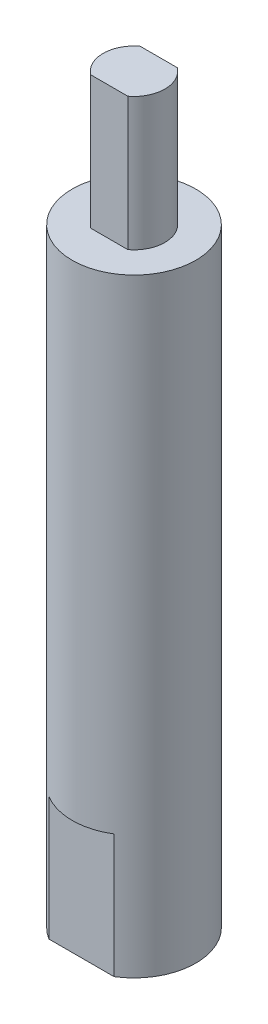
ISO-10303-21;
HEADER;
FILE_DESCRIPTION(('STEP AP214'),'2;1');
FILE_NAME('part.step','',(''),(''),'','','');
FILE_SCHEMA(('AUTOMOTIVE_DESIGN { 1 0 10303 214 1 1 1 1 }'));
ENDSEC;
DATA;
#1=APPLICATION_CONTEXT('core data for automotive mechanical design processes');
#2=APPLICATION_PROTOCOL_DEFINITION('international standard','automotive_design',2000,#1);
#3=PRODUCT_CONTEXT('',#1,'mechanical');
#4=PRODUCT('Part','Part','',(#3));
#5=PRODUCT_RELATED_PRODUCT_CATEGORY('part','',(#4));
#6=PRODUCT_DEFINITION_FORMATION('','',#4);
#7=PRODUCT_DEFINITION_CONTEXT('part definition',#1,'design');
#8=PRODUCT_DEFINITION('design','',#6,#7);
#9=PRODUCT_DEFINITION_SHAPE('','',#8);
#10=(LENGTH_UNIT() NAMED_UNIT(*) SI_UNIT(.MILLI.,.METRE.));
#11=(NAMED_UNIT(*) PLANE_ANGLE_UNIT() SI_UNIT($,.RADIAN.));
#12=(NAMED_UNIT(*) SI_UNIT($,.STERADIAN.) SOLID_ANGLE_UNIT());
#13=UNCERTAINTY_MEASURE_WITH_UNIT(LENGTH_MEASURE(1.E-05),#10,'distance_accuracy_value','');
#14=(GEOMETRIC_REPRESENTATION_CONTEXT(3) GLOBAL_UNCERTAINTY_ASSIGNED_CONTEXT((#13)) GLOBAL_UNIT_ASSIGNED_CONTEXT((#10,
#11,#12)) REPRESENTATION_CONTEXT('',''));
#15=CARTESIAN_POINT('',(0.,0.,0.));
#16=DIRECTION('',(0.,0.,1.));
#17=DIRECTION('',(1.,0.,0.));
#18=AXIS2_PLACEMENT_3D('',#15,#16,#17);
#19=CARTESIAN_POINT('',(0.,98.5,0.));
#20=DIRECTION('',(0.,1.,0.));
#21=DIRECTION('',(0.,0.,1.));
#22=AXIS2_PLACEMENT_3D('',#19,#20,#21);
#23=CYLINDRICAL_SURFACE('',#22,5.);
#24=DIRECTION('',(0.,1.,0.));
#25=VECTOR('',#24,1.);
#26=CARTESIAN_POINT('',(-3.,98.5,-4.));
#27=LINE('',#26,#25);
#28=CARTESIAN_POINT('',(-3.,98.5,-4.));
#29=VERTEX_POINT('',#28);
#30=CARTESIAN_POINT('',(-3.,120.,-4.));
#31=VERTEX_POINT('',#30);
#32=EDGE_CURVE('E63',#29,#31,#27,.T.);
#33=ORIENTED_EDGE('',*,*,#32,.F.);
#34=CARTESIAN_POINT('',(0.,98.5,0.));
#35=DIRECTION('',(0.,1.,0.));
#36=DIRECTION('',(0.,0.,1.));
#37=AXIS2_PLACEMENT_3D('',#34,#35,#36);
#38=CIRCLE('',#37,5.);
#39=CARTESIAN_POINT('',(-3.,98.5,4.));
#40=VERTEX_POINT('',#39);
#41=EDGE_CURVE('E138',#29,#40,#38,.T.);
#42=ORIENTED_EDGE('',*,*,#41,.T.);
#43=DIRECTION('',(0.,1.,0.));
#44=VECTOR('',#43,1.);
#45=CARTESIAN_POINT('',(-3.,98.5,4.));
#46=LINE('',#45,#44);
#47=CARTESIAN_POINT('',(-3.,120.,4.));
#48=VERTEX_POINT('',#47);
#49=EDGE_CURVE('E122',#48,#40,#46,.F.);
#50=ORIENTED_EDGE('',*,*,#49,.F.);
#51=CARTESIAN_POINT('',(0.,120.,0.));
#52=DIRECTION('',(0.,1.,0.));
#53=DIRECTION('',(0.,0.,1.));
#54=AXIS2_PLACEMENT_3D('',#51,#52,#53);
#55=CIRCLE('',#54,5.);
#56=EDGE_CURVE('E154',#31,#48,#55,.T.);
#57=ORIENTED_EDGE('',*,*,#56,.F.);
#58=EDGE_LOOP('',(#33,#42,#50,#57));
#59=FACE_BOUND('',#58,.T.);
#60=ADVANCED_FACE('F48',(#59),#23,.T.);
#61=CARTESIAN_POINT('',(0.,120.,0.));
#62=DIRECTION('',(0.,-1.,0.));
#63=DIRECTION('',(0.,0.,-1.));
#64=AXIS2_PLACEMENT_3D('',#61,#62,#63);
#65=CYLINDRICAL_SURFACE('',#64,10.);
#66=CARTESIAN_POINT('',(0.,20.,0.));
#67=DIRECTION('',(0.,1.,0.));
#68=DIRECTION('',(0.,0.,1.));
#69=AXIS2_PLACEMENT_3D('',#66,#67,#68);
#70=CIRCLE('',#69,10.);
#71=CARTESIAN_POINT('',(-5.26782687642637,20.,8.5));
#72=VERTEX_POINT('',#71);
#73=CARTESIAN_POINT('',(5.26782687642637,20.,8.5));
#74=VERTEX_POINT('',#73);
#75=EDGE_CURVE('E181',#72,#74,#70,.T.);
#76=ORIENTED_EDGE('',*,*,#75,.T.);
#77=DIRECTION('',(0.,-1.,0.));
#78=VECTOR('',#77,1.);
#79=CARTESIAN_POINT('',(5.26782687642637,120.,8.5));
#80=LINE('',#79,#78);
#81=CARTESIAN_POINT('',(5.26782687642637,0.,8.5));
#82=VERTEX_POINT('',#81);
#83=EDGE_CURVE('E224',#74,#82,#80,.T.);
#84=ORIENTED_EDGE('',*,*,#83,.T.);
#85=CARTESIAN_POINT('',(0.,0.,0.));
#86=DIRECTION('',(0.,1.,0.));
#87=DIRECTION('',(0.,0.,1.));
#88=AXIS2_PLACEMENT_3D('',#85,#86,#87);
#89=CIRCLE('',#88,10.);
#90=CARTESIAN_POINT('',(5.26782687642637,0.,-8.5));
#91=VERTEX_POINT('',#90);
#92=EDGE_CURVE('E168',#82,#91,#89,.T.);
#93=ORIENTED_EDGE('',*,*,#92,.T.);
#94=DIRECTION('',(0.,-1.,0.));
#95=VECTOR('',#94,1.);
#96=CARTESIAN_POINT('',(5.26782687642637,120.,-8.5));
#97=LINE('',#96,#95);
#98=CARTESIAN_POINT('',(5.26782687642637,20.,-8.5));
#99=VERTEX_POINT('',#98);
#100=EDGE_CURVE('E240',#91,#99,#97,.F.);
#101=ORIENTED_EDGE('',*,*,#100,.T.);
#102=CARTESIAN_POINT('',(0.,20.,0.));
#103=DIRECTION('',(0.,1.,0.));
#104=DIRECTION('',(0.,0.,1.));
#105=AXIS2_PLACEMENT_3D('',#102,#103,#104);
#106=CIRCLE('',#105,10.);
#107=CARTESIAN_POINT('',(-5.26782687642637,20.,-8.5));
#108=VERTEX_POINT('',#107);
#109=EDGE_CURVE('E177',#99,#108,#106,.T.);
#110=ORIENTED_EDGE('',*,*,#109,.T.);
#111=DIRECTION('',(0.,-1.,0.));
#112=VECTOR('',#111,1.);
#113=CARTESIAN_POINT('',(-5.26782687642637,120.,-8.5));
#114=LINE('',#113,#112);
#115=CARTESIAN_POINT('',(-5.26782687642637,0.,-8.5));
#116=VERTEX_POINT('',#115);
#117=EDGE_CURVE('E234',#108,#116,#114,.T.);
#118=ORIENTED_EDGE('',*,*,#117,.T.);
#119=CARTESIAN_POINT('',(-5.26782687642637,0.,8.5));
#120=VERTEX_POINT('',#119);
#121=EDGE_CURVE('E164',#116,#120,#89,.T.);
#122=ORIENTED_EDGE('',*,*,#121,.T.);
#123=DIRECTION('',(0.,-1.,0.));
#124=VECTOR('',#123,1.);
#125=CARTESIAN_POINT('',(-5.26782687642637,120.,8.5));
#126=LINE('',#125,#124);
#127=EDGE_CURVE('E229',#120,#72,#126,.F.);
#128=ORIENTED_EDGE('',*,*,#127,.T.);
#129=EDGE_LOOP('',(#76,#84,#93,#101,#110,#118,#122,#128));
#130=FACE_BOUND('',#129,.T.);
#131=CARTESIAN_POINT('',(0.,98.5,0.));
#132=DIRECTION('',(0.,1.,0.));
#133=DIRECTION('',(0.,0.,1.));
#134=AXIS2_PLACEMENT_3D('',#131,#132,#133);
#135=CIRCLE('',#134,10.);
#136=CARTESIAN_POINT('',(0.,98.5,10.));
#137=VERTEX_POINT('',#136);
#138=EDGE_CURVE('E151',#137,#137,#135,.T.);
#139=ORIENTED_EDGE('',*,*,#138,.F.);
#140=EDGE_LOOP('',(#139));
#141=FACE_BOUND('',#140,.T.);
#142=ADVANCED_FACE('F50',(#130,#141),#65,.T.);
#143=CARTESIAN_POINT('',(0.,0.,0.));
#144=DIRECTION('',(0.,1.,0.));
#145=DIRECTION('',(0.,0.,1.));
#146=AXIS2_PLACEMENT_3D('',#143,#144,#145);
#147=PLANE('',#146);
#148=CARTESIAN_POINT('',(0.,0.,0.));
#149=DIRECTION('',(0.,-1.,0.));
#150=DIRECTION('',(0.,0.,-1.));
#151=AXIS2_PLACEMENT_3D('',#148,#149,#150);
#152=CIRCLE('',#151,5.025);
#153=CARTESIAN_POINT('',(0.,0.,-5.025));
#154=VERTEX_POINT('',#153);
#155=EDGE_CURVE('E220',#154,#154,#152,.T.);
#156=ORIENTED_EDGE('',*,*,#155,.F.);
#157=EDGE_LOOP('',(#156));
#158=FACE_BOUND('',#157,.T.);
#159=ORIENTED_EDGE('',*,*,#92,.F.);
#160=DIRECTION('',(-1.,0.,0.));
#161=VECTOR('',#160,1.);
#162=CARTESIAN_POINT('',(0.,0.,8.5));
#163=LINE('',#162,#161);
#164=EDGE_CURVE('E173',#82,#120,#163,.T.);
#165=ORIENTED_EDGE('',*,*,#164,.T.);
#166=ORIENTED_EDGE('',*,*,#121,.F.);
#167=DIRECTION('',(1.,0.,0.));
#168=VECTOR('',#167,1.);
#169=CARTESIAN_POINT('',(0.,0.,-8.5));
#170=LINE('',#169,#168);
#171=EDGE_CURVE('E169',#116,#91,#170,.T.);
#172=ORIENTED_EDGE('',*,*,#171,.T.);
#173=EDGE_LOOP('',(#159,#165,#166,#172));
#174=FACE_BOUND('',#173,.T.);
#175=ADVANCED_FACE('F295',(#158,#174),#147,.F.);
#176=CARTESIAN_POINT('',(0.,98.5,0.));
#177=DIRECTION('',(0.,1.,0.));
#178=DIRECTION('',(0.,0.,1.));
#179=AXIS2_PLACEMENT_3D('',#176,#177,#178);
#180=PLANE('',#179);
#181=ORIENTED_EDGE('',*,*,#41,.F.);
#182=DIRECTION('',(-1.,0.,0.));
#183=VECTOR('',#182,1.);
#184=CARTESIAN_POINT('',(-10.,98.5,-4.));
#185=LINE('',#184,#183);
#186=CARTESIAN_POINT('',(3.,98.5,-4.));
#187=VERTEX_POINT('',#186);
#188=EDGE_CURVE('E142',#187,#29,#185,.T.);
#189=ORIENTED_EDGE('',*,*,#188,.F.);
#190=CARTESIAN_POINT('',(3.,98.5,4.));
#191=VERTEX_POINT('',#190);
#192=EDGE_CURVE('E140',#191,#187,#38,.T.);
#193=ORIENTED_EDGE('',*,*,#192,.F.);
#194=DIRECTION('',(1.,0.,0.));
#195=VECTOR('',#194,1.);
#196=CARTESIAN_POINT('',(-10.,98.5,4.));
#197=LINE('',#196,#195);
#198=EDGE_CURVE('E125',#40,#191,#197,.T.);
#199=ORIENTED_EDGE('',*,*,#198,.F.);
#200=EDGE_LOOP('',(#181,#189,#193,#199));
#201=FACE_BOUND('',#200,.T.);
#202=ORIENTED_EDGE('',*,*,#138,.T.);
#203=EDGE_LOOP('',(#202));
#204=FACE_BOUND('',#203,.T.);
#205=ADVANCED_FACE('F135',(#201,#204),#180,.T.);
#206=DIRECTION('',(0.,1.,0.));
#207=VECTOR('',#206,1.);
#208=CARTESIAN_POINT('',(3.,98.5,-4.));
#209=LINE('',#208,#207);
#210=CARTESIAN_POINT('',(3.,120.,-4.));
#211=VERTEX_POINT('',#210);
#212=EDGE_CURVE('E255',#211,#187,#209,.F.);
#213=ORIENTED_EDGE('',*,*,#212,.F.);
#214=CARTESIAN_POINT('',(3.,120.,4.));
#215=VERTEX_POINT('',#214);
#216=EDGE_CURVE('E145',#215,#211,#55,.T.);
#217=ORIENTED_EDGE('',*,*,#216,.F.);
#218=DIRECTION('',(0.,1.,0.));
#219=VECTOR('',#218,1.);
#220=CARTESIAN_POINT('',(3.,98.5,4.));
#221=LINE('',#220,#219);
#222=EDGE_CURVE('E71',#191,#215,#221,.T.);
#223=ORIENTED_EDGE('',*,*,#222,.F.);
#224=ORIENTED_EDGE('',*,*,#192,.T.);
#225=EDGE_LOOP('',(#213,#217,#223,#224));
#226=FACE_BOUND('',#225,.T.);
#227=ADVANCED_FACE('F275',(#226),#23,.T.);
#228=CARTESIAN_POINT('',(0.,120.,0.));
#229=DIRECTION('',(0.,1.,0.));
#230=DIRECTION('',(0.,0.,1.));
#231=AXIS2_PLACEMENT_3D('',#228,#229,#230);
#232=PLANE('',#231);
#233=DIRECTION('',(1.,0.,0.));
#234=VECTOR('',#233,1.);
#235=CARTESIAN_POINT('',(0.,120.,-4.));
#236=LINE('',#235,#234);
#237=EDGE_CURVE('E11',#31,#211,#236,.T.);
#238=ORIENTED_EDGE('',*,*,#237,.F.);
#239=ORIENTED_EDGE('',*,*,#56,.T.);
#240=DIRECTION('',(-1.,0.,0.));
#241=VECTOR('',#240,1.);
#242=CARTESIAN_POINT('',(0.,120.,4.));
#243=LINE('',#242,#241);
#244=EDGE_CURVE('E57',#215,#48,#243,.T.);
#245=ORIENTED_EDGE('',*,*,#244,.F.);
#246=ORIENTED_EDGE('',*,*,#216,.T.);
#247=EDGE_LOOP('',(#238,#239,#245,#246));
#248=FACE_BOUND('',#247,.T.);
#249=ADVANCED_FACE('F278',(#248),#232,.T.);
#250=CARTESIAN_POINT('',(0.,35.,0.));
#251=DIRECTION('',(0.,-1.,0.));
#252=DIRECTION('',(0.,0.,-1.));
#253=AXIS2_PLACEMENT_3D('',#250,#251,#252);
#254=CONICAL_SURFACE('',#253,4.24999999999999,1.02974425867665);
#255=CARTESIAN_POINT('',(0.,37.5536576308671,0.));
#256=VERTEX_POINT('',#255);
#257=VERTEX_LOOP('',#256);
#258=FACE_BOUND('',#257,.T.);
#259=CARTESIAN_POINT('',(0.,35.,0.));
#260=DIRECTION('',(0.,-1.,0.));
#261=DIRECTION('',(0.,0.,-1.));
#262=AXIS2_PLACEMENT_3D('',#259,#260,#261);
#263=CIRCLE('',#262,4.24999999999999);
#264=CARTESIAN_POINT('',(0.,35.,-4.24999999999999));
#265=VERTEX_POINT('',#264);
#266=EDGE_CURVE('E157',#265,#265,#263,.T.);
#267=ORIENTED_EDGE('',*,*,#266,.T.);
#268=EDGE_LOOP('',(#267));
#269=FACE_BOUND('',#268,.T.);
#270=ADVANCED_FACE('F280',(#258,#269),#254,.F.);
#271=CARTESIAN_POINT('',(0.,0.,0.));
#272=DIRECTION('',(0.,-1.,0.));
#273=DIRECTION('',(0.,0.,-1.));
#274=AXIS2_PLACEMENT_3D('',#271,#272,#273);
#275=CYLINDRICAL_SURFACE('',#274,4.24999999999999);
#276=ORIENTED_EDGE('',*,*,#266,.F.);
#277=EDGE_LOOP('',(#276));
#278=FACE_BOUND('',#277,.T.);
#279=CARTESIAN_POINT('',(0.,0.775000000000008,0.));
#280=DIRECTION('',(0.,-1.,0.));
#281=DIRECTION('',(0.,0.,-1.));
#282=AXIS2_PLACEMENT_3D('',#279,#280,#281);
#283=CIRCLE('',#282,4.25);
#284=CARTESIAN_POINT('',(0.,0.775000000000008,-4.25));
#285=VERTEX_POINT('',#284);
#286=EDGE_CURVE('E216',#285,#285,#283,.T.);
#287=ORIENTED_EDGE('',*,*,#286,.T.);
#288=EDGE_LOOP('',(#287));
#289=FACE_BOUND('',#288,.T.);
#290=ADVANCED_FACE('F286',(#278,#289),#275,.F.);
#291=CARTESIAN_POINT('',(0.,0.,0.));
#292=DIRECTION('',(0.,-1.,0.));
#293=DIRECTION('',(0.,0.,-1.));
#294=AXIS2_PLACEMENT_3D('',#291,#292,#293);
#295=CONICAL_SURFACE('',#294,5.025,0.785398163397446);
#296=ORIENTED_EDGE('',*,*,#286,.F.);
#297=EDGE_LOOP('',(#296));
#298=FACE_BOUND('',#297,.T.);
#299=ORIENTED_EDGE('',*,*,#155,.T.);
#300=EDGE_LOOP('',(#299));
#301=FACE_BOUND('',#300,.T.);
#302=ADVANCED_FACE('F331',(#298,#301),#295,.F.);
#303=CARTESIAN_POINT('',(0.,20.,0.));
#304=DIRECTION('',(0.,1.,0.));
#305=DIRECTION('',(0.,0.,1.));
#306=AXIS2_PLACEMENT_3D('',#303,#304,#305);
#307=PLANE('',#306);
#308=DIRECTION('',(-1.,0.,0.));
#309=VECTOR('',#308,1.);
#310=CARTESIAN_POINT('',(-10.,20.,-8.5));
#311=LINE('',#310,#309);
#312=EDGE_CURVE('E250',#99,#108,#311,.T.);
#313=ORIENTED_EDGE('',*,*,#312,.T.);
#314=ORIENTED_EDGE('',*,*,#109,.F.);
#315=EDGE_LOOP('',(#313,#314));
#316=FACE_BOUND('',#315,.T.);
#317=ADVANCED_FACE('F324',(#316),#307,.F.);
#318=CARTESIAN_POINT('',(-10.,20.,-8.5));
#319=DIRECTION('',(0.,0.,1.));
#320=DIRECTION('',(1.,0.,0.));
#321=AXIS2_PLACEMENT_3D('',#318,#319,#320);
#322=PLANE('',#321);
#323=ORIENTED_EDGE('',*,*,#312,.F.);
#324=ORIENTED_EDGE('',*,*,#100,.F.);
#325=ORIENTED_EDGE('',*,*,#171,.F.);
#326=ORIENTED_EDGE('',*,*,#117,.F.);
#327=EDGE_LOOP('',(#323,#324,#325,#326));
#328=FACE_BOUND('',#327,.T.);
#329=ADVANCED_FACE('F317',(#328),#322,.F.);
#330=CARTESIAN_POINT('',(0.,20.,0.));
#331=DIRECTION('',(0.,1.,0.));
#332=DIRECTION('',(0.,0.,1.));
#333=AXIS2_PLACEMENT_3D('',#330,#331,#332);
#334=PLANE('',#333);
#335=ORIENTED_EDGE('',*,*,#75,.F.);
#336=DIRECTION('',(1.,0.,0.));
#337=VECTOR('',#336,1.);
#338=CARTESIAN_POINT('',(-10.,20.,8.5));
#339=LINE('',#338,#337);
#340=EDGE_CURVE('E245',#72,#74,#339,.T.);
#341=ORIENTED_EDGE('',*,*,#340,.T.);
#342=EDGE_LOOP('',(#335,#341));
#343=FACE_BOUND('',#342,.T.);
#344=ADVANCED_FACE('F315',(#343),#334,.F.);
#345=CARTESIAN_POINT('',(-10.,20.,8.5));
#346=DIRECTION('',(0.,0.,-1.));
#347=DIRECTION('',(-1.,0.,0.));
#348=AXIS2_PLACEMENT_3D('',#345,#346,#347);
#349=PLANE('',#348);
#350=ORIENTED_EDGE('',*,*,#340,.F.);
#351=ORIENTED_EDGE('',*,*,#127,.F.);
#352=ORIENTED_EDGE('',*,*,#164,.F.);
#353=ORIENTED_EDGE('',*,*,#83,.F.);
#354=EDGE_LOOP('',(#350,#351,#352,#353));
#355=FACE_BOUND('',#354,.T.);
#356=ADVANCED_FACE('F313',(#355),#349,.F.);
#357=CARTESIAN_POINT('',(-10.,78.4750156054992,4.));
#358=DIRECTION('',(0.,0.,-1.));
#359=DIRECTION('',(-1.,0.,0.));
#360=AXIS2_PLACEMENT_3D('',#357,#358,#359);
#361=PLANE('',#360);
#362=ORIENTED_EDGE('',*,*,#49,.T.);
#363=ORIENTED_EDGE('',*,*,#198,.T.);
#364=ORIENTED_EDGE('',*,*,#222,.T.);
#365=ORIENTED_EDGE('',*,*,#244,.T.);
#366=EDGE_LOOP('',(#362,#363,#364,#365));
#367=FACE_BOUND('',#366,.T.);
#368=ADVANCED_FACE('F124',(#367),#361,.F.);
#369=CARTESIAN_POINT('',(-10.,78.4750156054992,-4.));
#370=DIRECTION('',(0.,0.,1.));
#371=DIRECTION('',(1.,0.,0.));
#372=AXIS2_PLACEMENT_3D('',#369,#370,#371);
#373=PLANE('',#372);
#374=ORIENTED_EDGE('',*,*,#212,.T.);
#375=ORIENTED_EDGE('',*,*,#188,.T.);
#376=ORIENTED_EDGE('',*,*,#32,.T.);
#377=ORIENTED_EDGE('',*,*,#237,.T.);
#378=EDGE_LOOP('',(#374,#375,#376,#377));
#379=FACE_BOUND('',#378,.T.);
#380=ADVANCED_FACE('F272',(#379),#373,.F.);
#381=CLOSED_SHELL('',(#60,#142,#175,#205,#227,#249,#270,#290,#302,#317,#329,#344,#356,#368,#380));
#382=MANIFOLD_SOLID_BREP('B2',#381);
#383=ADVANCED_BREP_SHAPE_REPRESENTATION('',(#18,#382),#14);
#384=SHAPE_DEFINITION_REPRESENTATION(#9,#383);
ENDSEC;
END-ISO-10303-21;
